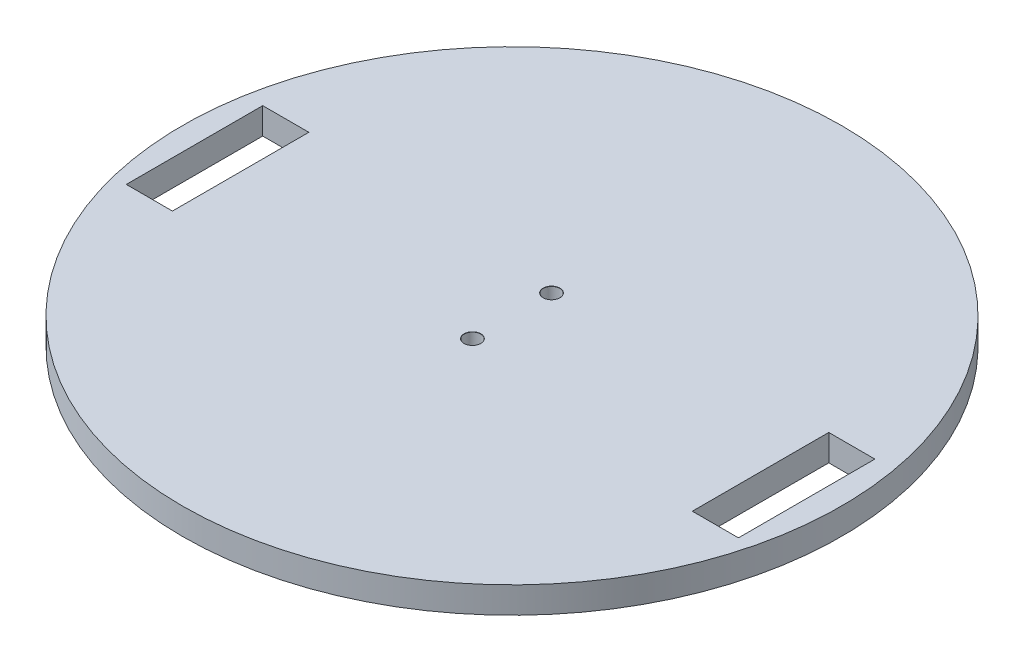
ISO-10303-21;
HEADER;
FILE_DESCRIPTION(('STEP AP214'),'2;1');
FILE_NAME('part.step','',(''),(''),'','','');
FILE_SCHEMA(('AUTOMOTIVE_DESIGN { 1 0 10303 214 1 1 1 1 }'));
ENDSEC;
DATA;
#1=APPLICATION_CONTEXT('core data for automotive mechanical design processes');
#2=APPLICATION_PROTOCOL_DEFINITION('international standard','automotive_design',2000,#1);
#3=PRODUCT_CONTEXT('',#1,'mechanical');
#4=PRODUCT('Part','Part','',(#3));
#5=PRODUCT_RELATED_PRODUCT_CATEGORY('part','',(#4));
#6=PRODUCT_DEFINITION_FORMATION('','',#4);
#7=PRODUCT_DEFINITION_CONTEXT('part definition',#1,'design');
#8=PRODUCT_DEFINITION('design','',#6,#7);
#9=PRODUCT_DEFINITION_SHAPE('','',#8);
#10=(LENGTH_UNIT() NAMED_UNIT(*) SI_UNIT(.MILLI.,.METRE.));
#11=(NAMED_UNIT(*) PLANE_ANGLE_UNIT() SI_UNIT($,.RADIAN.));
#12=(NAMED_UNIT(*) SI_UNIT($,.STERADIAN.) SOLID_ANGLE_UNIT());
#13=UNCERTAINTY_MEASURE_WITH_UNIT(LENGTH_MEASURE(1.E-05),#10,'distance_accuracy_value','');
#14=(GEOMETRIC_REPRESENTATION_CONTEXT(3) GLOBAL_UNCERTAINTY_ASSIGNED_CONTEXT((#13)) GLOBAL_UNIT_ASSIGNED_CONTEXT((#10,
#11,#12)) REPRESENTATION_CONTEXT('',''));
#15=CARTESIAN_POINT('',(0.,0.,0.));
#16=DIRECTION('',(0.,0.,1.));
#17=DIRECTION('',(1.,0.,0.));
#18=AXIS2_PLACEMENT_3D('',#15,#16,#17);
#19=CARTESIAN_POINT('',(0.,4.,0.));
#20=DIRECTION('',(0.,1.,0.));
#21=DIRECTION('',(0.,0.,1.));
#22=AXIS2_PLACEMENT_3D('',#19,#20,#21);
#23=PLANE('',#22);
#24=DIRECTION('',(-1.,0.,0.));
#25=VECTOR('',#24,1.);
#26=CARTESIAN_POINT('',(0.,4.,-8.7));
#27=LINE('',#26,#25);
#28=CARTESIAN_POINT('',(46.3569886888483,4.,-8.7));
#29=VERTEX_POINT('',#28);
#30=CARTESIAN_POINT('',(39.3569886888483,4.,-8.7));
#31=VERTEX_POINT('',#30);
#32=EDGE_CURVE('E160',#29,#31,#27,.T.);
#33=ORIENTED_EDGE('',*,*,#32,.F.);
#34=DIRECTION('',(0.,0.,-1.));
#35=VECTOR('',#34,1.);
#36=CARTESIAN_POINT('',(46.3569886888483,4.,0.));
#37=LINE('',#36,#35);
#38=CARTESIAN_POINT('',(46.3569886888483,4.,12.));
#39=VERTEX_POINT('',#38);
#40=EDGE_CURVE('E132',#39,#29,#37,.T.);
#41=ORIENTED_EDGE('',*,*,#40,.F.);
#42=DIRECTION('',(-1.,0.,0.));
#43=VECTOR('',#42,1.);
#44=CARTESIAN_POINT('',(0.,4.,12.));
#45=LINE('',#44,#43);
#46=CARTESIAN_POINT('',(39.3569886888483,4.,12.));
#47=VERTEX_POINT('',#46);
#48=EDGE_CURVE('E154',#39,#47,#45,.T.);
#49=ORIENTED_EDGE('',*,*,#48,.T.);
#50=DIRECTION('',(0.,0.,-1.));
#51=VECTOR('',#50,1.);
#52=CARTESIAN_POINT('',(39.3569886888483,4.,0.));
#53=LINE('',#52,#51);
#54=EDGE_CURVE('E157',#47,#31,#53,.T.);
#55=ORIENTED_EDGE('',*,*,#54,.T.);
#56=EDGE_LOOP('',(#33,#41,#49,#55));
#57=FACE_BOUND('',#56,.T.);
#58=CARTESIAN_POINT('',(0.,4.,-6.));
#59=DIRECTION('',(0.,1.,0.));
#60=DIRECTION('',(0.,0.,1.));
#61=AXIS2_PLACEMENT_3D('',#58,#59,#60);
#62=CIRCLE('',#61,1.275);
#63=CARTESIAN_POINT('',(0.,4.,-4.725));
#64=VERTEX_POINT('',#63);
#65=EDGE_CURVE('E170',#64,#64,#62,.T.);
#66=ORIENTED_EDGE('',*,*,#65,.F.);
#67=EDGE_LOOP('',(#66));
#68=FACE_BOUND('',#67,.T.);
#69=CARTESIAN_POINT('',(0.,4.,6.));
#70=DIRECTION('',(0.,1.,0.));
#71=DIRECTION('',(0.,0.,1.));
#72=AXIS2_PLACEMENT_3D('',#69,#70,#71);
#73=CIRCLE('',#72,1.275);
#74=CARTESIAN_POINT('',(0.,4.,7.275));
#75=VERTEX_POINT('',#74);
#76=EDGE_CURVE('E179',#75,#75,#73,.T.);
#77=ORIENTED_EDGE('',*,*,#76,.F.);
#78=EDGE_LOOP('',(#77));
#79=FACE_BOUND('',#78,.T.);
#80=CARTESIAN_POINT('',(0.,4.,0.));
#81=DIRECTION('',(0.,1.,0.));
#82=DIRECTION('',(0.,0.,1.));
#83=AXIS2_PLACEMENT_3D('',#80,#81,#82);
#84=CIRCLE('',#83,50.);
#85=CARTESIAN_POINT('',(0.,4.,50.));
#86=VERTEX_POINT('',#85);
#87=EDGE_CURVE('E11',#86,#86,#84,.T.);
#88=ORIENTED_EDGE('',*,*,#87,.T.);
#89=EDGE_LOOP('',(#88));
#90=FACE_BOUND('',#89,.T.);
#91=DIRECTION('',(1.,0.,0.));
#92=VECTOR('',#91,1.);
#93=CARTESIAN_POINT('',(0.,4.,12.));
#94=LINE('',#93,#92);
#95=CARTESIAN_POINT('',(-46.5198017607313,4.,12.));
#96=VERTEX_POINT('',#95);
#97=CARTESIAN_POINT('',(-39.5198017607313,4.,12.));
#98=VERTEX_POINT('',#97);
#99=EDGE_CURVE('E165',#96,#98,#94,.T.);
#100=ORIENTED_EDGE('',*,*,#99,.F.);
#101=DIRECTION('',(0.,0.,-1.));
#102=VECTOR('',#101,1.);
#103=CARTESIAN_POINT('',(-46.5198017607313,4.,0.));
#104=LINE('',#103,#102);
#105=CARTESIAN_POINT('',(-46.5198017607313,4.,-8.7));
#106=VERTEX_POINT('',#105);
#107=EDGE_CURVE('E167',#96,#106,#104,.T.);
#108=ORIENTED_EDGE('',*,*,#107,.T.);
#109=DIRECTION('',(1.,0.,0.));
#110=VECTOR('',#109,1.);
#111=CARTESIAN_POINT('',(0.,4.,-8.7));
#112=LINE('',#111,#110);
#113=CARTESIAN_POINT('',(-39.5198017607313,4.,-8.7));
#114=VERTEX_POINT('',#113);
#115=EDGE_CURVE('E162',#106,#114,#112,.T.);
#116=ORIENTED_EDGE('',*,*,#115,.T.);
#117=DIRECTION('',(0.,0.,-1.));
#118=VECTOR('',#117,1.);
#119=CARTESIAN_POINT('',(-39.5198017607313,4.,0.));
#120=LINE('',#119,#118);
#121=EDGE_CURVE('E109',#98,#114,#120,.T.);
#122=ORIENTED_EDGE('',*,*,#121,.F.);
#123=EDGE_LOOP('',(#100,#108,#116,#122));
#124=FACE_BOUND('',#123,.T.);
#125=ADVANCED_FACE('F39',(#57,#68,#79,#90,#124),#23,.T.);
#126=CARTESIAN_POINT('',(0.,0.,0.));
#127=DIRECTION('',(0.,1.,0.));
#128=DIRECTION('',(0.,0.,1.));
#129=AXIS2_PLACEMENT_3D('',#126,#127,#128);
#130=PLANE('',#129);
#131=CARTESIAN_POINT('',(0.,0.,0.));
#132=DIRECTION('',(0.,1.,0.));
#133=DIRECTION('',(0.,0.,1.));
#134=AXIS2_PLACEMENT_3D('',#131,#132,#133);
#135=CIRCLE('',#134,50.);
#136=CARTESIAN_POINT('',(0.,0.,50.));
#137=VERTEX_POINT('',#136);
#138=EDGE_CURVE('E43',#137,#137,#135,.T.);
#139=ORIENTED_EDGE('',*,*,#138,.F.);
#140=EDGE_LOOP('',(#139));
#141=FACE_BOUND('',#140,.T.);
#142=CARTESIAN_POINT('',(0.,0.,6.));
#143=DIRECTION('',(0.,1.,0.));
#144=DIRECTION('',(0.,0.,1.));
#145=AXIS2_PLACEMENT_3D('',#142,#143,#144);
#146=CIRCLE('',#145,1.25);
#147=CARTESIAN_POINT('',(0.,0.,7.25));
#148=VERTEX_POINT('',#147);
#149=EDGE_CURVE('E185',#148,#148,#146,.T.);
#150=ORIENTED_EDGE('',*,*,#149,.T.);
#151=EDGE_LOOP('',(#150));
#152=FACE_BOUND('',#151,.T.);
#153=CARTESIAN_POINT('',(0.,0.,-6.));
#154=DIRECTION('',(0.,1.,0.));
#155=DIRECTION('',(0.,0.,1.));
#156=AXIS2_PLACEMENT_3D('',#153,#154,#155);
#157=CIRCLE('',#156,1.25);
#158=CARTESIAN_POINT('',(0.,0.,-4.75));
#159=VERTEX_POINT('',#158);
#160=EDGE_CURVE('E176',#159,#159,#157,.T.);
#161=ORIENTED_EDGE('',*,*,#160,.T.);
#162=EDGE_LOOP('',(#161));
#163=FACE_BOUND('',#162,.T.);
#164=DIRECTION('',(0.,0.,1.));
#165=VECTOR('',#164,1.);
#166=CARTESIAN_POINT('',(46.3569886888483,0.,0.));
#167=LINE('',#166,#165);
#168=CARTESIAN_POINT('',(46.3569886888483,0.,-8.7));
#169=VERTEX_POINT('',#168);
#170=CARTESIAN_POINT('',(46.3569886888483,0.,12.));
#171=VERTEX_POINT('',#170);
#172=EDGE_CURVE('E137',#169,#171,#167,.T.);
#173=ORIENTED_EDGE('',*,*,#172,.F.);
#174=DIRECTION('',(1.,0.,0.));
#175=VECTOR('',#174,1.);
#176=CARTESIAN_POINT('',(0.,0.,-8.7));
#177=LINE('',#176,#175);
#178=CARTESIAN_POINT('',(39.3569886888483,0.,-8.7));
#179=VERTEX_POINT('',#178);
#180=EDGE_CURVE('E135',#179,#169,#177,.T.);
#181=ORIENTED_EDGE('',*,*,#180,.F.);
#182=DIRECTION('',(0.,0.,1.));
#183=VECTOR('',#182,1.);
#184=CARTESIAN_POINT('',(39.3569886888483,0.,0.));
#185=LINE('',#184,#183);
#186=CARTESIAN_POINT('',(39.3569886888483,0.,12.));
#187=VERTEX_POINT('',#186);
#188=EDGE_CURVE('E142',#179,#187,#185,.T.);
#189=ORIENTED_EDGE('',*,*,#188,.T.);
#190=DIRECTION('',(1.,0.,0.));
#191=VECTOR('',#190,1.);
#192=CARTESIAN_POINT('',(0.,0.,12.));
#193=LINE('',#192,#191);
#194=EDGE_CURVE('E139',#187,#171,#193,.T.);
#195=ORIENTED_EDGE('',*,*,#194,.T.);
#196=EDGE_LOOP('',(#173,#181,#189,#195));
#197=FACE_BOUND('',#196,.T.);
#198=DIRECTION('',(0.,0.,1.));
#199=VECTOR('',#198,1.);
#200=CARTESIAN_POINT('',(-46.5198017607313,0.,0.));
#201=LINE('',#200,#199);
#202=CARTESIAN_POINT('',(-46.5198017607313,0.,-8.7));
#203=VERTEX_POINT('',#202);
#204=CARTESIAN_POINT('',(-46.5198017607313,0.,12.));
#205=VERTEX_POINT('',#204);
#206=EDGE_CURVE('E121',#203,#205,#201,.T.);
#207=ORIENTED_EDGE('',*,*,#206,.T.);
#208=DIRECTION('',(-1.,0.,0.));
#209=VECTOR('',#208,1.);
#210=CARTESIAN_POINT('',(0.,0.,12.));
#211=LINE('',#210,#209);
#212=CARTESIAN_POINT('',(-39.5198017607313,0.,12.));
#213=VERTEX_POINT('',#212);
#214=EDGE_CURVE('E125',#213,#205,#211,.T.);
#215=ORIENTED_EDGE('',*,*,#214,.F.);
#216=DIRECTION('',(0.,0.,1.));
#217=VECTOR('',#216,1.);
#218=CARTESIAN_POINT('',(-39.5198017607313,0.,0.));
#219=LINE('',#218,#217);
#220=CARTESIAN_POINT('',(-39.5198017607313,0.,-8.7));
#221=VERTEX_POINT('',#220);
#222=EDGE_CURVE('E106',#221,#213,#219,.T.);
#223=ORIENTED_EDGE('',*,*,#222,.F.);
#224=DIRECTION('',(-1.,0.,0.));
#225=VECTOR('',#224,1.);
#226=CARTESIAN_POINT('',(0.,0.,-8.7));
#227=LINE('',#226,#225);
#228=EDGE_CURVE('E116',#221,#203,#227,.T.);
#229=ORIENTED_EDGE('',*,*,#228,.T.);
#230=EDGE_LOOP('',(#207,#215,#223,#229));
#231=FACE_BOUND('',#230,.T.);
#232=ADVANCED_FACE('F123',(#141,#152,#163,#197,#231),#130,.F.);
#233=CARTESIAN_POINT('',(0.,4.,0.));
#234=DIRECTION('',(0.,-1.,0.));
#235=DIRECTION('',(0.,0.,-1.));
#236=AXIS2_PLACEMENT_3D('',#233,#234,#235);
#237=CYLINDRICAL_SURFACE('',#236,50.);
#238=ORIENTED_EDGE('',*,*,#87,.F.);
#239=EDGE_LOOP('',(#238));
#240=FACE_BOUND('',#239,.T.);
#241=ORIENTED_EDGE('',*,*,#138,.T.);
#242=EDGE_LOOP('',(#241));
#243=FACE_BOUND('',#242,.T.);
#244=ADVANCED_FACE('F41',(#240,#243),#237,.T.);
#245=CARTESIAN_POINT('',(0.,4.,6.));
#246=DIRECTION('',(0.,1.,0.));
#247=DIRECTION('',(0.,0.,1.));
#248=AXIS2_PLACEMENT_3D('',#245,#246,#247);
#249=CYLINDRICAL_SURFACE('',#248,1.25);
#250=ORIENTED_EDGE('',*,*,#149,.F.);
#251=EDGE_LOOP('',(#250));
#252=FACE_BOUND('',#251,.T.);
#253=CARTESIAN_POINT('',(0.,3.975,6.));
#254=DIRECTION('',(0.,1.,0.));
#255=DIRECTION('',(0.,0.,1.));
#256=AXIS2_PLACEMENT_3D('',#253,#254,#255);
#257=CIRCLE('',#256,1.25);
#258=CARTESIAN_POINT('',(0.,3.975,7.25));
#259=VERTEX_POINT('',#258);
#260=EDGE_CURVE('E182',#259,#259,#257,.T.);
#261=ORIENTED_EDGE('',*,*,#260,.T.);
#262=EDGE_LOOP('',(#261));
#263=FACE_BOUND('',#262,.T.);
#264=ADVANCED_FACE('F230',(#252,#263),#249,.F.);
#265=CARTESIAN_POINT('',(0.,4.,6.));
#266=DIRECTION('',(0.,1.,0.));
#267=DIRECTION('',(0.,0.,1.));
#268=AXIS2_PLACEMENT_3D('',#265,#266,#267);
#269=CONICAL_SURFACE('',#268,1.275,0.785398163397414);
#270=ORIENTED_EDGE('',*,*,#260,.F.);
#271=EDGE_LOOP('',(#270));
#272=FACE_BOUND('',#271,.T.);
#273=ORIENTED_EDGE('',*,*,#76,.T.);
#274=EDGE_LOOP('',(#273));
#275=FACE_BOUND('',#274,.T.);
#276=ADVANCED_FACE('F233',(#272,#275),#269,.F.);
#277=CARTESIAN_POINT('',(0.,4.,-6.));
#278=DIRECTION('',(0.,1.,0.));
#279=DIRECTION('',(0.,0.,1.));
#280=AXIS2_PLACEMENT_3D('',#277,#278,#279);
#281=CYLINDRICAL_SURFACE('',#280,1.25);
#282=ORIENTED_EDGE('',*,*,#160,.F.);
#283=EDGE_LOOP('',(#282));
#284=FACE_BOUND('',#283,.T.);
#285=CARTESIAN_POINT('',(0.,3.975,-6.));
#286=DIRECTION('',(0.,1.,0.));
#287=DIRECTION('',(0.,0.,1.));
#288=AXIS2_PLACEMENT_3D('',#285,#286,#287);
#289=CIRCLE('',#288,1.25);
#290=CARTESIAN_POINT('',(0.,3.975,-4.75));
#291=VERTEX_POINT('',#290);
#292=EDGE_CURVE('E173',#291,#291,#289,.T.);
#293=ORIENTED_EDGE('',*,*,#292,.T.);
#294=EDGE_LOOP('',(#293));
#295=FACE_BOUND('',#294,.T.);
#296=ADVANCED_FACE('F237',(#284,#295),#281,.F.);
#297=CARTESIAN_POINT('',(0.,4.,-6.));
#298=DIRECTION('',(0.,1.,0.));
#299=DIRECTION('',(0.,0.,1.));
#300=AXIS2_PLACEMENT_3D('',#297,#298,#299);
#301=CONICAL_SURFACE('',#300,1.275,0.785398163397414);
#302=ORIENTED_EDGE('',*,*,#292,.F.);
#303=EDGE_LOOP('',(#302));
#304=FACE_BOUND('',#303,.T.);
#305=ORIENTED_EDGE('',*,*,#65,.T.);
#306=EDGE_LOOP('',(#305));
#307=FACE_BOUND('',#306,.T.);
#308=ADVANCED_FACE('F241',(#304,#307),#301,.F.);
#309=CARTESIAN_POINT('',(0.,10.,-8.7));
#310=DIRECTION('',(0.,0.,-1.));
#311=DIRECTION('',(-1.,0.,0.));
#312=AXIS2_PLACEMENT_3D('',#309,#310,#311);
#313=PLANE('',#312);
#314=ORIENTED_EDGE('',*,*,#32,.T.);
#315=DIRECTION('',(0.,-1.,0.));
#316=VECTOR('',#315,1.);
#317=CARTESIAN_POINT('',(39.3569886888483,10.,-8.7));
#318=LINE('',#317,#316);
#319=EDGE_CURVE('E146',#31,#179,#318,.T.);
#320=ORIENTED_EDGE('',*,*,#319,.T.);
#321=ORIENTED_EDGE('',*,*,#180,.T.);
#322=DIRECTION('',(0.,-1.,0.));
#323=VECTOR('',#322,1.);
#324=CARTESIAN_POINT('',(46.3569886888483,10.,-8.7));
#325=LINE('',#324,#323);
#326=EDGE_CURVE('E145',#29,#169,#325,.T.);
#327=ORIENTED_EDGE('',*,*,#326,.F.);
#328=EDGE_LOOP('',(#314,#320,#321,#327));
#329=FACE_BOUND('',#328,.T.);
#330=ADVANCED_FACE('F205',(#329),#313,.F.);
#331=CARTESIAN_POINT('',(39.3569886888483,10.,0.));
#332=DIRECTION('',(1.,0.,0.));
#333=DIRECTION('',(0.,0.,-1.));
#334=AXIS2_PLACEMENT_3D('',#331,#332,#333);
#335=PLANE('',#334);
#336=DIRECTION('',(0.,-1.,0.));
#337=VECTOR('',#336,1.);
#338=CARTESIAN_POINT('',(39.3569886888483,10.,12.));
#339=LINE('',#338,#337);
#340=EDGE_CURVE('E148',#47,#187,#339,.T.);
#341=ORIENTED_EDGE('',*,*,#340,.T.);
#342=ORIENTED_EDGE('',*,*,#188,.F.);
#343=ORIENTED_EDGE('',*,*,#319,.F.);
#344=ORIENTED_EDGE('',*,*,#54,.F.);
#345=EDGE_LOOP('',(#341,#342,#343,#344));
#346=FACE_BOUND('',#345,.T.);
#347=ADVANCED_FACE('F211',(#346),#335,.T.);
#348=CARTESIAN_POINT('',(0.,10.,12.));
#349=DIRECTION('',(0.,0.,-1.));
#350=DIRECTION('',(-1.,0.,0.));
#351=AXIS2_PLACEMENT_3D('',#348,#349,#350);
#352=PLANE('',#351);
#353=DIRECTION('',(0.,-1.,0.));
#354=VECTOR('',#353,1.);
#355=CARTESIAN_POINT('',(46.3569886888483,10.,12.));
#356=LINE('',#355,#354);
#357=EDGE_CURVE('E62',#39,#171,#356,.T.);
#358=ORIENTED_EDGE('',*,*,#357,.T.);
#359=ORIENTED_EDGE('',*,*,#194,.F.);
#360=ORIENTED_EDGE('',*,*,#340,.F.);
#361=ORIENTED_EDGE('',*,*,#48,.F.);
#362=EDGE_LOOP('',(#358,#359,#360,#361));
#363=FACE_BOUND('',#362,.T.);
#364=ADVANCED_FACE('F214',(#363),#352,.T.);
#365=CARTESIAN_POINT('',(46.3569886888483,10.,0.));
#366=DIRECTION('',(1.,0.,0.));
#367=DIRECTION('',(0.,0.,-1.));
#368=AXIS2_PLACEMENT_3D('',#365,#366,#367);
#369=PLANE('',#368);
#370=ORIENTED_EDGE('',*,*,#40,.T.);
#371=ORIENTED_EDGE('',*,*,#326,.T.);
#372=ORIENTED_EDGE('',*,*,#172,.T.);
#373=ORIENTED_EDGE('',*,*,#357,.F.);
#374=EDGE_LOOP('',(#370,#371,#372,#373));
#375=FACE_BOUND('',#374,.T.);
#376=ADVANCED_FACE('F200',(#375),#369,.F.);
#377=CARTESIAN_POINT('',(-46.5198017607313,10.,0.));
#378=DIRECTION('',(1.,0.,0.));
#379=DIRECTION('',(0.,0.,-1.));
#380=AXIS2_PLACEMENT_3D('',#377,#378,#379);
#381=PLANE('',#380);
#382=DIRECTION('',(0.,-1.,0.));
#383=VECTOR('',#382,1.);
#384=CARTESIAN_POINT('',(-46.5198017607313,10.,12.));
#385=LINE('',#384,#383);
#386=EDGE_CURVE('E130',#96,#205,#385,.T.);
#387=ORIENTED_EDGE('',*,*,#386,.T.);
#388=ORIENTED_EDGE('',*,*,#206,.F.);
#389=DIRECTION('',(0.,-1.,0.));
#390=VECTOR('',#389,1.);
#391=CARTESIAN_POINT('',(-46.5198017607313,10.,-8.7));
#392=LINE('',#391,#390);
#393=EDGE_CURVE('E112',#106,#203,#392,.T.);
#394=ORIENTED_EDGE('',*,*,#393,.F.);
#395=ORIENTED_EDGE('',*,*,#107,.F.);
#396=EDGE_LOOP('',(#387,#388,#394,#395));
#397=FACE_BOUND('',#396,.T.);
#398=ADVANCED_FACE('F221',(#397),#381,.T.);
#399=CARTESIAN_POINT('',(0.,10.,12.));
#400=DIRECTION('',(0.,0.,1.));
#401=DIRECTION('',(1.,0.,0.));
#402=AXIS2_PLACEMENT_3D('',#399,#400,#401);
#403=PLANE('',#402);
#404=ORIENTED_EDGE('',*,*,#99,.T.);
#405=DIRECTION('',(0.,-1.,0.));
#406=VECTOR('',#405,1.);
#407=CARTESIAN_POINT('',(-39.5198017607313,10.,12.));
#408=LINE('',#407,#406);
#409=EDGE_CURVE('E111',#98,#213,#408,.T.);
#410=ORIENTED_EDGE('',*,*,#409,.T.);
#411=ORIENTED_EDGE('',*,*,#214,.T.);
#412=ORIENTED_EDGE('',*,*,#386,.F.);
#413=EDGE_LOOP('',(#404,#410,#411,#412));
#414=FACE_BOUND('',#413,.T.);
#415=ADVANCED_FACE('F276',(#414),#403,.F.);
#416=CARTESIAN_POINT('',(-39.5198017607313,10.,0.));
#417=DIRECTION('',(1.,0.,0.));
#418=DIRECTION('',(0.,0.,-1.));
#419=AXIS2_PLACEMENT_3D('',#416,#417,#418);
#420=PLANE('',#419);
#421=ORIENTED_EDGE('',*,*,#121,.T.);
#422=DIRECTION('',(0.,-1.,0.));
#423=VECTOR('',#422,1.);
#424=CARTESIAN_POINT('',(-39.5198017607313,10.,-8.7));
#425=LINE('',#424,#423);
#426=EDGE_CURVE('E54',#114,#221,#425,.T.);
#427=ORIENTED_EDGE('',*,*,#426,.T.);
#428=ORIENTED_EDGE('',*,*,#222,.T.);
#429=ORIENTED_EDGE('',*,*,#409,.F.);
#430=EDGE_LOOP('',(#421,#427,#428,#429));
#431=FACE_BOUND('',#430,.T.);
#432=ADVANCED_FACE('F103',(#431),#420,.F.);
#433=CARTESIAN_POINT('',(0.,10.,-8.7));
#434=DIRECTION('',(0.,0.,1.));
#435=DIRECTION('',(1.,0.,0.));
#436=AXIS2_PLACEMENT_3D('',#433,#434,#435);
#437=PLANE('',#436);
#438=ORIENTED_EDGE('',*,*,#393,.T.);
#439=ORIENTED_EDGE('',*,*,#228,.F.);
#440=ORIENTED_EDGE('',*,*,#426,.F.);
#441=ORIENTED_EDGE('',*,*,#115,.F.);
#442=EDGE_LOOP('',(#438,#439,#440,#441));
#443=FACE_BOUND('',#442,.T.);
#444=ADVANCED_FACE('F117',(#443),#437,.T.);
#445=CLOSED_SHELL('',(#125,#232,#244,#264,#276,#296,#308,#330,#347,#364,#376,#398,#415,#432,#444));
#446=MANIFOLD_SOLID_BREP('B2',#445);
#447=ADVANCED_BREP_SHAPE_REPRESENTATION('',(#18,#446),#14);
#448=SHAPE_DEFINITION_REPRESENTATION(#9,#447);
ENDSEC;
END-ISO-10303-21;
